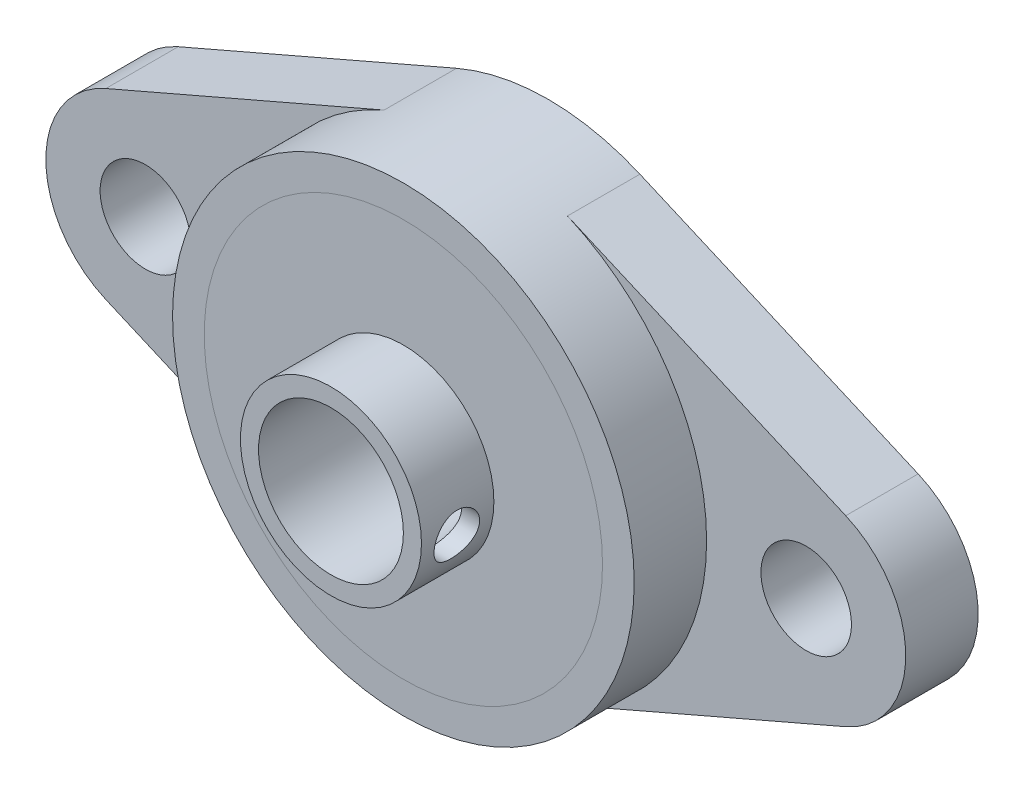
ISO-10303-21;
HEADER;
FILE_DESCRIPTION(('STEP AP214'),'2;1');
FILE_NAME('part.step','',(''),(''),'','','');
FILE_SCHEMA(('AUTOMOTIVE_DESIGN { 1 0 10303 214 1 1 1 1 }'));
ENDSEC;
DATA;
#1=APPLICATION_CONTEXT('core data for automotive mechanical design processes');
#2=APPLICATION_PROTOCOL_DEFINITION('international standard','automotive_design',2000,#1);
#3=PRODUCT_CONTEXT('',#1,'mechanical');
#4=PRODUCT('Part','Part','',(#3));
#5=PRODUCT_RELATED_PRODUCT_CATEGORY('part','',(#4));
#6=PRODUCT_DEFINITION_FORMATION('','',#4);
#7=PRODUCT_DEFINITION_CONTEXT('part definition',#1,'design');
#8=PRODUCT_DEFINITION('design','',#6,#7);
#9=PRODUCT_DEFINITION_SHAPE('','',#8);
#10=(LENGTH_UNIT() NAMED_UNIT(*) SI_UNIT(.MILLI.,.METRE.));
#11=(NAMED_UNIT(*) PLANE_ANGLE_UNIT() SI_UNIT($,.RADIAN.));
#12=(NAMED_UNIT(*) SI_UNIT($,.STERADIAN.) SOLID_ANGLE_UNIT());
#13=UNCERTAINTY_MEASURE_WITH_UNIT(LENGTH_MEASURE(1.E-05),#10,'distance_accuracy_value','');
#14=(GEOMETRIC_REPRESENTATION_CONTEXT(3) GLOBAL_UNCERTAINTY_ASSIGNED_CONTEXT((#13)) GLOBAL_UNIT_ASSIGNED_CONTEXT((#10,
#11,#12)) REPRESENTATION_CONTEXT('',''));
#15=CARTESIAN_POINT('',(0.,0.,0.));
#16=DIRECTION('',(0.,0.,1.));
#17=DIRECTION('',(1.,0.,0.));
#18=AXIS2_PLACEMENT_3D('',#15,#16,#17);
#19=CARTESIAN_POINT('',(0.,0.,8.));
#20=DIRECTION('',(0.,0.,1.));
#21=DIRECTION('',(1.,0.,0.));
#22=AXIS2_PLACEMENT_3D('',#19,#20,#21);
#23=PLANE('',#22);
#24=CARTESIAN_POINT('',(0.,0.,8.));
#25=DIRECTION('',(0.,0.,1.));
#26=DIRECTION('',(1.,0.,0.));
#27=AXIS2_PLACEMENT_3D('',#24,#25,#26);
#28=CIRCLE('',#27,11.);
#29=CARTESIAN_POINT('',(11.,0.,8.));
#30=VERTEX_POINT('',#29);
#31=EDGE_CURVE('E59',#30,#30,#28,.T.);
#32=ORIENTED_EDGE('',*,*,#31,.T.);
#33=EDGE_LOOP('',(#32));
#34=FACE_BOUND('',#33,.T.);
#35=CARTESIAN_POINT('',(0.,0.,8.));
#36=DIRECTION('',(0.,0.,1.));
#37=DIRECTION('',(1.,0.,0.));
#38=AXIS2_PLACEMENT_3D('',#35,#36,#37);
#39=CIRCLE('',#38,5.);
#40=CARTESIAN_POINT('',(5.,0.,8.));
#41=VERTEX_POINT('',#40);
#42=EDGE_CURVE('E68',#41,#41,#39,.T.);
#43=ORIENTED_EDGE('',*,*,#42,.F.);
#44=EDGE_LOOP('',(#43));
#45=FACE_BOUND('',#44,.T.);
#46=ADVANCED_FACE('F48',(#34,#45),#23,.T.);
#47=CARTESIAN_POINT('',(0.,0.,4.));
#48=DIRECTION('',(0.,0.,1.));
#49=DIRECTION('',(1.,0.,0.));
#50=AXIS2_PLACEMENT_3D('',#47,#48,#49);
#51=PLANE('',#50);
#52=CARTESIAN_POINT('',(0.,0.,4.));
#53=DIRECTION('',(0.,0.,1.));
#54=DIRECTION('',(1.,0.,0.));
#55=AXIS2_PLACEMENT_3D('',#52,#53,#54);
#56=CIRCLE('',#55,11.);
#57=CARTESIAN_POINT('',(11.,0.,4.));
#58=VERTEX_POINT('',#57);
#59=EDGE_CURVE('E63',#58,#58,#56,.T.);
#60=ORIENTED_EDGE('',*,*,#59,.F.);
#61=EDGE_LOOP('',(#60));
#62=FACE_BOUND('',#61,.T.);
#63=CARTESIAN_POINT('',(0.,0.,4.));
#64=DIRECTION('',(0.,0.,1.));
#65=DIRECTION('',(1.,0.,0.));
#66=AXIS2_PLACEMENT_3D('',#63,#64,#65);
#67=CIRCLE('',#66,5.);
#68=CARTESIAN_POINT('',(5.,0.,4.));
#69=VERTEX_POINT('',#68);
#70=EDGE_CURVE('E72',#69,#69,#67,.F.);
#71=ORIENTED_EDGE('',*,*,#70,.F.);
#72=EDGE_LOOP('',(#71));
#73=FACE_BOUND('',#72,.T.);
#74=ADVANCED_FACE('F107',(#62,#73),#51,.F.);
#75=CARTESIAN_POINT('',(0.,0.,8.));
#76=DIRECTION('',(0.,0.,-1.));
#77=DIRECTION('',(-1.,0.,0.));
#78=AXIS2_PLACEMENT_3D('',#75,#76,#77);
#79=CYLINDRICAL_SURFACE('',#78,11.);
#80=ORIENTED_EDGE('',*,*,#31,.F.);
#81=EDGE_LOOP('',(#80));
#82=FACE_BOUND('',#81,.T.);
#83=ORIENTED_EDGE('',*,*,#59,.T.);
#84=EDGE_LOOP('',(#83));
#85=FACE_BOUND('',#84,.T.);
#86=ADVANCED_FACE('F50',(#82,#85),#79,.T.);
#87=CARTESIAN_POINT('',(0.,0.,12.));
#88=DIRECTION('',(0.,0.,-1.));
#89=DIRECTION('',(-1.,0.,0.));
#90=AXIS2_PLACEMENT_3D('',#87,#88,#89);
#91=CYLINDRICAL_SURFACE('',#90,5.);
#92=CARTESIAN_POINT('',(0.,0.,0.));
#93=DIRECTION('',(0.,0.,1.));
#94=DIRECTION('',(1.,0.,0.));
#95=AXIS2_PLACEMENT_3D('',#92,#93,#94);
#96=CIRCLE('',#95,5.);
#97=CARTESIAN_POINT('',(5.,0.,0.));
#98=VERTEX_POINT('',#97);
#99=EDGE_CURVE('E76',#98,#98,#96,.T.);
#100=ORIENTED_EDGE('',*,*,#99,.T.);
#101=EDGE_LOOP('',(#100));
#102=FACE_BOUND('',#101,.T.);
#103=ORIENTED_EDGE('',*,*,#70,.T.);
#104=EDGE_LOOP('',(#103));
#105=FACE_BOUND('',#104,.T.);
#106=ADVANCED_FACE('F118',(#102,#105),#91,.T.);
#107=CARTESIAN_POINT('',(0.,0.,12.));
#108=DIRECTION('',(0.,0.,1.));
#109=DIRECTION('',(1.,0.,0.));
#110=AXIS2_PLACEMENT_3D('',#107,#108,#109);
#111=PLANE('',#110);
#112=CARTESIAN_POINT('',(0.,0.,12.));
#113=DIRECTION('',(0.,0.,1.));
#114=DIRECTION('',(1.,0.,0.));
#115=AXIS2_PLACEMENT_3D('',#112,#113,#114);
#116=CIRCLE('',#115,5.);
#117=CARTESIAN_POINT('',(5.,0.,12.));
#118=VERTEX_POINT('',#117);
#119=EDGE_CURVE('E75',#118,#118,#116,.T.);
#120=ORIENTED_EDGE('',*,*,#119,.T.);
#121=EDGE_LOOP('',(#120));
#122=FACE_BOUND('',#121,.T.);
#123=CARTESIAN_POINT('',(0.,0.,12.));
#124=DIRECTION('',(0.,0.,1.));
#125=DIRECTION('',(1.,0.,0.));
#126=AXIS2_PLACEMENT_3D('',#123,#124,#125);
#127=CIRCLE('',#126,4.);
#128=CARTESIAN_POINT('',(4.,0.,12.));
#129=VERTEX_POINT('',#128);
#130=EDGE_CURVE('E79',#129,#129,#127,.T.);
#131=ORIENTED_EDGE('',*,*,#130,.F.);
#132=EDGE_LOOP('',(#131));
#133=FACE_BOUND('',#132,.T.);
#134=ADVANCED_FACE('F120',(#122,#133),#111,.T.);
#135=CARTESIAN_POINT('',(0.,0.,0.));
#136=DIRECTION('',(0.,0.,1.));
#137=DIRECTION('',(1.,0.,0.));
#138=AXIS2_PLACEMENT_3D('',#135,#136,#137);
#139=PLANE('',#138);
#140=ORIENTED_EDGE('',*,*,#99,.F.);
#141=EDGE_LOOP('',(#140));
#142=FACE_BOUND('',#141,.T.);
#143=CARTESIAN_POINT('',(0.,0.,0.));
#144=DIRECTION('',(0.,0.,1.));
#145=DIRECTION('',(1.,0.,0.));
#146=AXIS2_PLACEMENT_3D('',#143,#144,#145);
#147=CIRCLE('',#146,4.);
#148=CARTESIAN_POINT('',(4.,0.,0.));
#149=VERTEX_POINT('',#148);
#150=EDGE_CURVE('E82',#149,#149,#147,.T.);
#151=ORIENTED_EDGE('',*,*,#150,.T.);
#152=EDGE_LOOP('',(#151));
#153=FACE_BOUND('',#152,.T.);
#154=ADVANCED_FACE('F117',(#142,#153),#139,.F.);
#155=CARTESIAN_POINT('',(4.95473362883362,-0.671278382867513,8.75000000000001));
#156=CARTESIAN_POINT('',(4.94512432398613,-0.742192184027193,8.75000258028003));
#157=CARTESIAN_POINT('',(4.93397593841791,-0.812928784277491,8.75605538247951));
#158=CARTESIAN_POINT('',(4.90905107504939,-0.951956265350667,8.77987504923985));
#159=CARTESIAN_POINT('',(4.89527214535078,-1.02024479325679,8.7976528808097));
#160=CARTESIAN_POINT('',(4.8658600629558,-1.15237989223721,8.8441725561435));
#161=CARTESIAN_POINT('',(4.85023073550853,-1.21623520865513,8.87289204431075));
#162=CARTESIAN_POINT('',(4.81803674006436,-1.3380952361234,8.94041992332771));
#163=CARTESIAN_POINT('',(4.80147205783771,-1.39609985812858,8.97922846769658));
#164=CARTESIAN_POINT('',(4.76799723314187,-1.50653007767853,9.06726800584633));
#165=CARTESIAN_POINT('',(4.75109165377322,-1.55873583929604,9.11677697856215));
#166=CARTESIAN_POINT('',(4.71873919427298,-1.65409837841083,9.2242889502439));
#167=CARTESIAN_POINT('',(4.70329244443491,-1.6972543480566,9.28229270673292));
#168=CARTESIAN_POINT('',(4.675266151163,-1.77299616881338,9.40510704021256));
#169=CARTESIAN_POINT('',(4.66267399498911,-1.80562879779027,9.46988574985182));
#170=CARTESIAN_POINT('',(4.64152109126352,-1.85933420411227,9.60467960500248));
#171=CARTESIAN_POINT('',(4.63295805750083,-1.88041353816828,9.67469175474622));
#172=CARTESIAN_POINT('',(4.62119831490188,-1.90912346666035,9.81314673869915));
#173=CARTESIAN_POINT('',(4.61769290440751,-1.91752927291539,9.88140266574818));
#174=CARTESIAN_POINT('',(4.61540944150434,-1.9230203060244,10.0184379238637));
#175=CARTESIAN_POINT('',(4.61662989764989,-1.9201091044342,10.0872170829645));
#176=CARTESIAN_POINT('',(4.62348510743728,-1.90353778121265,10.219708272131));
#177=CARTESIAN_POINT('',(4.62889568129619,-1.89042339056808,10.2835015450174));
#178=CARTESIAN_POINT('',(4.64335437913708,-1.85462384871559,10.4079024793509));
#179=CARTESIAN_POINT('',(4.6524029719482,-1.83193746395237,10.4685097290785));
#180=CARTESIAN_POINT('',(4.67365107281098,-1.77703971934372,10.5866402357642));
#181=CARTESIAN_POINT('',(4.68592761680718,-1.7445922185518,10.6440394620895));
#182=CARTESIAN_POINT('',(4.71253772867026,-1.67137750447181,10.7527277735878));
#183=CARTESIAN_POINT('',(4.72687195785737,-1.63060761466331,10.8040148846497));
#184=CARTESIAN_POINT('',(4.75761998917701,-1.53868603957769,10.9027517676194));
#185=CARTESIAN_POINT('',(4.77410903634523,-1.48701212674901,10.9496926101847));
#186=CARTESIAN_POINT('',(4.80711218902607,-1.37658697744447,11.0343512919694));
#187=CARTESIAN_POINT('',(4.82362629992038,-1.31783391239703,11.0720667405791));
#188=CARTESIAN_POINT('',(4.85618602915876,-1.19239280008988,11.1384881965996));
#189=CARTESIAN_POINT('',(4.87219278810207,-1.12549392771584,11.1668168115672));
#190=CARTESIAN_POINT('',(4.90205061482996,-0.987363356298275,11.2115517705921));
#191=CARTESIAN_POINT('',(4.91590203916821,-0.91613237662602,11.2279600882567));
#192=CARTESIAN_POINT('',(4.94037761164704,-0.773173614906652,11.2478767859426));
#193=CARTESIAN_POINT('',(4.9510726303712,-0.701500943577721,11.2516919190146));
#194=CARTESIAN_POINT('',(4.96927228161294,-0.558164420466073,11.246933506599));
#195=CARTESIAN_POINT('',(4.97677775753725,-0.486500571367544,11.2383632388082));
#196=CARTESIAN_POINT('',(4.98831152908671,-0.348366693935925,11.2095460579959));
#197=CARTESIAN_POINT('',(4.99246976396494,-0.281804183870605,11.1897922575645));
#198=CARTESIAN_POINT('',(4.99808297157258,-0.152771517038234,11.1394931234056));
#199=CARTESIAN_POINT('',(4.99953807439839,-0.090301163463396,11.1089483091124));
#200=CARTESIAN_POINT('',(5.00026866188326,0.0281283384276601,11.0382865199636));
#201=CARTESIAN_POINT('',(4.99956566033651,0.0841460166167359,10.9982676732101));
#202=CARTESIAN_POINT('',(4.99670745072671,0.188844627957427,10.9096124501691));
#203=CARTESIAN_POINT('',(4.99455211528812,0.237524917132107,10.8609753182992));
#204=CARTESIAN_POINT('',(4.98950337169292,0.326954225428666,10.7555689075752));
#205=CARTESIAN_POINT('',(4.98659873377749,0.367564273907156,10.6986822371489));
#206=CARTESIAN_POINT('',(4.98084058501877,0.438756648747818,10.5789423870591));
#207=CARTESIAN_POINT('',(4.97798707655181,0.469338510169739,10.5160889309297));
#208=CARTESIAN_POINT('',(4.97296626581298,0.519867091939617,10.3855122540718));
#209=CARTESIAN_POINT('',(4.97080585379997,0.539708295290015,10.317747880148));
#210=CARTESIAN_POINT('',(4.96768517942538,0.567719351552085,10.1798225954252));
#211=CARTESIAN_POINT('',(4.96672486397624,0.575889720737981,10.1096617907759));
#212=CARTESIAN_POINT('',(4.96621093975135,0.580305037020225,9.96933798849631));
#213=CARTESIAN_POINT('',(4.96664982202863,0.576613640728685,9.89917701646992));
#214=CARTESIAN_POINT('',(4.96882511523487,0.557554680523268,9.76048073887894));
#215=CARTESIAN_POINT('',(4.97056153830366,0.542187007365736,9.69194544853048));
#216=CARTESIAN_POINT('',(4.974955786359,0.50025491259147,9.55853385251147));
#217=CARTESIAN_POINT('',(4.97761227716077,0.473706691847854,9.49365240594934));
#218=CARTESIAN_POINT('',(4.98324973854332,0.410164288151079,9.36923744412605));
#219=CARTESIAN_POINT('',(4.98623072428223,0.373169617083942,9.30970417893189));
#220=CARTESIAN_POINT('',(4.99178947355156,0.289486355009067,9.19727134935337));
#221=CARTESIAN_POINT('',(4.99436453907587,0.242737336768629,9.14441660009683));
#222=CARTESIAN_POINT('',(4.99827050120662,0.140987762025899,9.04728283748373));
#223=CARTESIAN_POINT('',(4.99960129512639,0.0859865249228866,9.00300453215901));
#224=CARTESIAN_POINT('',(5.00024420327807,-0.030397619228588,8.92451174216448));
#225=CARTESIAN_POINT('',(4.99956624755665,-0.0917476922812463,8.89024866959376));
#226=CARTESIAN_POINT('',(4.99559768351135,-0.219215359578227,8.83251299855222));
#227=CARTESIAN_POINT('',(4.99230920124695,-0.285329034437858,8.80903164381041));
#228=CARTESIAN_POINT('',(4.98385504731463,-0.404873827838776,8.77752989309636));
#229=CARTESIAN_POINT('',(4.97928957999224,-0.457753209205068,8.76720328809396));
#230=CARTESIAN_POINT('',(4.96835242328858,-0.564214781792941,8.7534373516042));
#231=CARTESIAN_POINT('',(4.96198072501683,-0.617796976472618,8.74999805401766));
#232=CARTESIAN_POINT('',(4.95473362883362,-0.671278382867513,8.75000000000001));
#233=B_SPLINE_CURVE_WITH_KNOTS('',3,(#155,#156,#157,#158,#159,#160,#161,#162,#163,#164,#165,
#166,#167,#168,#169,#170,#171,#172,#173,#174,#175,#176,#177,#178,#179,#180,#181,#182,#183,#184,
#185,#186,#187,#188,#189,#190,#191,#192,#193,#194,#195,#196,#197,#198,#199,#200,#201,#202,#203,
#204,#205,#206,#207,#208,#209,#210,#211,#212,#213,#214,#215,#216,#217,#218,#219,#220,#221,#222,
#223,#224,#225,#226,#227,#228,#229,#230,#231,#232),.UNSPECIFIED.,.T.,.F.,(4,2,2,2,2,2,2,2,2,2,2,
2,2,2,2,2,2,2,2,2,2,2,2,2,2,2,2,2,2,2,2,2,2,2,2,2,2,2,4),(0.,0.214481445895414,
0.429163792117538,0.643409839252829,0.857659146633592,1.07834210545147,1.29904475568778,
1.51875237454171,1.73833517576273,1.94384765203175,2.1492952754971,2.34445177901437,
2.53963344028856,2.73997945733794,2.94039000843232,3.1546284286122,3.36892230649357,
3.59100695185729,3.81305481895405,4.02965234880117,4.24619256834811,4.45385527708148,
4.6615079911604,4.86709739432015,5.07270483084813,5.28159349440073,5.49049184136069,
5.70140680223967,5.91231243273757,6.12208812428009,6.33186577851548,6.54134050029492,
6.75082501147271,6.96164798451843,7.17248835473017,7.38228819902899,7.59191735366251,
7.75367307290599,7.91542958834461),.UNSPECIFIED.);
#234=CARTESIAN_POINT('',(4.95473362883362,-0.671278382867513,8.75000000000001));
#235=VERTEX_POINT('',#234);
#236=EDGE_CURVE('E11',#235,#235,#233,.T.);
#237=ORIENTED_EDGE('',*,*,#236,.T.);
#238=EDGE_LOOP('',(#237));
#239=FACE_BOUND('',#238,.T.);
#240=ORIENTED_EDGE('',*,*,#42,.T.);
#241=EDGE_LOOP('',(#240));
#242=FACE_BOUND('',#241,.T.);
#243=ORIENTED_EDGE('',*,*,#119,.F.);
#244=EDGE_LOOP('',(#243));
#245=FACE_BOUND('',#244,.T.);
#246=ADVANCED_FACE('F103',(#239,#242,#245),#91,.T.);
#247=CARTESIAN_POINT('',(0.,0.,12.));
#248=DIRECTION('',(0.,0.,-1.));
#249=DIRECTION('',(-1.,0.,0.));
#250=AXIS2_PLACEMENT_3D('',#247,#248,#249);
#251=CYLINDRICAL_SURFACE('',#250,4.);
#252=CARTESIAN_POINT('',(3.94327089263403,-0.671278382867513,8.75000000000001));
#253=CARTESIAN_POINT('',(3.93114196248786,-0.742517118784526,8.75000189235861));
#254=CARTESIAN_POINT('',(3.91706292991898,-0.813442686777589,8.75611112829209));
#255=CARTESIAN_POINT('',(3.88558193044837,-0.95255085886349,8.78000955090203));
#256=CARTESIAN_POINT('',(3.86817741743792,-1.02073131245372,8.79780771265915));
#257=CARTESIAN_POINT('',(3.83101739258076,-1.15237689983369,8.84418797642203));
#258=CARTESIAN_POINT('',(3.81126883657208,-1.215855119799,8.87273869275271));
#259=CARTESIAN_POINT('',(3.7705091916413,-1.33691630214914,8.93971005372522));
#260=CARTESIAN_POINT('',(3.74949792546057,-1.39449843376185,8.97813208658872));
#261=CARTESIAN_POINT('',(3.70648133401174,-1.50522248035507,9.0660429701896));
#262=CARTESIAN_POINT('',(3.68447772517108,-1.55800878525753,9.11598168781022));
#263=CARTESIAN_POINT('',(3.64218759691293,-1.6544630456805,9.2246757769556));
#264=CARTESIAN_POINT('',(3.62190151271173,-1.69812869413823,9.28343337276483));
#265=CARTESIAN_POINT('',(3.58494062374308,-1.77482774164582,9.40836278351827));
#266=CARTESIAN_POINT('',(3.56825654479299,-1.80788855463148,9.47451487586516));
#267=CARTESIAN_POINT('',(3.5403052226424,-1.86203645796701,9.61260119050216));
#268=CARTESIAN_POINT('',(3.52903185890208,-1.88313708246196,9.68452877155682));
#269=CARTESIAN_POINT('',(3.51419551228336,-1.91066720180612,9.82410048576407));
#270=CARTESIAN_POINT('',(3.50995543820638,-1.91838879739744,9.89141778502608));
#271=CARTESIAN_POINT('',(3.50753067864982,-1.92282046484765,10.0265108603823));
#272=CARTESIAN_POINT('',(3.50934317692844,-1.91953565794662,10.0942864086083));
#273=CARTESIAN_POINT('',(3.51839857546887,-1.90287823806946,10.222475555077));
#274=CARTESIAN_POINT('',(3.52518258136448,-1.8903575359295,10.2830361796933));
#275=CARTESIAN_POINT('',(3.54298490611242,-1.85677581805526,10.4010774306992));
#276=CARTESIAN_POINT('',(3.55400408618153,-1.83571306525875,10.458557427937));
#277=CARTESIAN_POINT('',(3.57991467553788,-1.78467425091387,10.5717316965974));
#278=CARTESIAN_POINT('',(3.59495867766409,-1.75433814317093,10.6272276232991));
#279=CARTESIAN_POINT('',(3.62747411357035,-1.68607819426941,10.732546336218));
#280=CARTESIAN_POINT('',(3.64494661333234,-1.64815101779884,10.7823666135551));
#281=CARTESIAN_POINT('',(3.68320267632826,-1.56093803224926,10.8807947591354));
#282=CARTESIAN_POINT('',(3.70413776246198,-1.51085515085325,10.9286390111189));
#283=CARTESIAN_POINT('',(3.74612671890757,-1.40351599209565,11.0154287773813));
#284=CARTESIAN_POINT('',(3.76718063783222,-1.3462565396419,11.0543703312171));
#285=CARTESIAN_POINT('',(3.80934451784821,-1.22206601814079,11.1245091172014));
#286=CARTESIAN_POINT('',(3.83037937946737,-1.15475785470774,11.1550881672074));
#287=CARTESIAN_POINT('',(3.86973399275118,-1.01509330587347,11.2040608291551));
#288=CARTESIAN_POINT('',(3.88805445060211,-0.942738240717363,11.2224576148024));
#289=CARTESIAN_POINT('',(3.92031851273057,-0.797755750773608,11.2456699138986));
#290=CARTESIAN_POINT('',(3.93439735237753,-0.725234456974304,11.2509561823421));
#291=CARTESIAN_POINT('',(3.95845494922682,-0.579710963976722,11.248760880202));
#292=CARTESIAN_POINT('',(3.96843554001067,-0.506708994721986,11.2412850272075));
#293=CARTESIAN_POINT('',(3.98366738622146,-0.36740765499213,11.2144401437408));
#294=CARTESIAN_POINT('',(3.98918388640216,-0.300981053751118,11.1958757775946));
#295=CARTESIAN_POINT('',(3.99682648538346,-0.171923105052158,11.1479894795265));
#296=CARTESIAN_POINT('',(3.99895287432757,-0.109291433245655,11.1186684684789));
#297=CARTESIAN_POINT('',(4.00042118486959,0.00921359014119998,11.0507202939798));
#298=CARTESIAN_POINT('',(3.99981282505052,0.065188775674636,11.0122712403536));
#299=CARTESIAN_POINT('',(3.99672474133152,0.170155551372265,10.926859529259));
#300=CARTESIAN_POINT('',(3.99424479169194,0.219146298268953,10.8798958453275));
#301=CARTESIAN_POINT('',(3.98824120759921,0.309927062284755,10.7775127324718));
#302=CARTESIAN_POINT('',(3.98469438097803,0.351520446945472,10.7219202925361));
#303=CARTESIAN_POINT('',(3.97753490235486,0.424949026439982,10.6046270296734));
#304=CARTESIAN_POINT('',(3.97392224462759,0.456783368204862,10.5429256733699));
#305=CARTESIAN_POINT('',(3.96741348201169,0.510267422771577,10.4140039045436));
#306=CARTESIAN_POINT('',(3.96453028879444,0.531739011010742,10.346708789416));
#307=CARTESIAN_POINT('',(3.96020371075766,0.563062819402668,10.2094234555288));
#308=CARTESIAN_POINT('',(3.95876022452089,0.572915858009475,10.1394334269677));
#309=CARTESIAN_POINT('',(3.95762967352997,0.580674613977201,9.99930822932565));
#310=CARTESIAN_POINT('',(3.9579294956811,0.578669525733758,9.92917810030345));
#311=CARTESIAN_POINT('',(3.96019105938593,0.562981422839712,9.79026525269803));
#312=CARTESIAN_POINT('',(3.96215280966564,0.549298346873441,9.72148254119141));
#313=CARTESIAN_POINT('',(3.9673071170453,0.510732455511152,9.5874508673718));
#314=CARTESIAN_POINT('',(3.97049528388256,0.485889536921058,9.52219023644103));
#315=CARTESIAN_POINT('',(3.97739585129282,0.425717015892196,9.39672339631489));
#316=CARTESIAN_POINT('',(3.98110829980257,0.390386454208743,9.33651765010736));
#317=CARTESIAN_POINT('',(3.98819210826899,0.309792860159651,9.22222255621485));
#318=CARTESIAN_POINT('',(3.99155965202438,0.264433280120915,9.16820099356957));
#319=CARTESIAN_POINT('',(3.99689347738651,0.165237058599386,9.06850348661821));
#320=CARTESIAN_POINT('',(3.99885973047979,0.111400244649073,9.02282771214627));
#321=CARTESIAN_POINT('',(4.00040423137438,-0.00288190270296989,8.94139695684292));
#322=CARTESIAN_POINT('',(3.99999626362391,-0.0632870951251969,8.90558597129714));
#323=CARTESIAN_POINT('',(3.99602054623327,-0.189131600218819,8.84461426113502));
#324=CARTESIAN_POINT('',(3.99245475853429,-0.254567764119292,8.81944693799581));
#325=CARTESIAN_POINT('',(3.98246346100204,-0.378500883825389,8.7833189375766));
#326=CARTESIAN_POINT('',(3.9765391335161,-0.436592041464689,8.77080722060984));
#327=CARTESIAN_POINT('',(3.96194194024203,-0.553619169168558,8.75414679802883));
#328=CARTESIAN_POINT('',(3.95326896020328,-0.612555174252853,8.7499984400991));
#329=CARTESIAN_POINT('',(3.94327089263403,-0.671278382867513,8.75000000000001));
#330=B_SPLINE_CURVE_WITH_KNOTS('',3,(#252,#253,#254,#255,#256,#257,#258,#259,#260,#261,#262,
#263,#264,#265,#266,#267,#268,#269,#270,#271,#272,#273,#274,#275,#276,#277,#278,#279,#280,#281,
#282,#283,#284,#285,#286,#287,#288,#289,#290,#291,#292,#293,#294,#295,#296,#297,#298,#299,#300,
#301,#302,#303,#304,#305,#306,#307,#308,#309,#310,#311,#312,#313,#314,#315,#316,#317,#318,#319,
#320,#321,#322,#323,#324,#325,#326,#327,#328,#329),.UNSPECIFIED.,.T.,.F.,(4,2,2,2,2,2,2,2,2,2,2,
2,2,2,2,2,2,2,2,2,2,2,2,2,2,2,2,2,2,2,2,2,2,2,2,2,2,2,4),(0.,0.21656070219716,0.433287880404443,
0.64938729498855,0.865517116687611,1.09223268563284,1.31900553283726,1.54518734815601,
1.77111270260099,1.97366193100594,2.17611692706243,2.3619206309276,2.54776213772505,
2.74200889594918,2.93634118908869,3.15248390740611,3.36872259240844,3.59816701098355,
3.8275516314947,4.04857219085197,4.26949375623531,4.47605503673809,4.68259863769351,
4.88540255216391,5.08823093150428,5.29583346332057,5.50345413716186,5.71452662275323,
5.92558423872168,6.13505635183576,6.344529564797,6.5532597914671,6.76200911538188,
6.97286304408317,7.18372126311718,7.39335649001363,7.60286156266795,7.78136852914644,
7.95988291642691),.UNSPECIFIED.);
#331=CARTESIAN_POINT('',(3.94327089263403,-0.671278382867513,8.75000000000001));
#332=VERTEX_POINT('',#331);
#333=EDGE_CURVE('E85',#332,#332,#330,.T.);
#334=ORIENTED_EDGE('',*,*,#333,.F.);
#335=EDGE_LOOP('',(#334));
#336=FACE_BOUND('',#335,.T.);
#337=ORIENTED_EDGE('',*,*,#130,.T.);
#338=EDGE_LOOP('',(#337));
#339=FACE_BOUND('',#338,.T.);
#340=ORIENTED_EDGE('',*,*,#150,.F.);
#341=EDGE_LOOP('',(#340));
#342=FACE_BOUND('',#341,.T.);
#343=ADVANCED_FACE('F92',(#336,#339,#342),#251,.F.);
#344=CARTESIAN_POINT('',(5.,-0.671278382867513,10.));
#345=DIRECTION('',(1.,0.,0.));
#346=DIRECTION('',(0.,0.,-1.));
#347=AXIS2_PLACEMENT_3D('',#344,#345,#346);
#348=CYLINDRICAL_SURFACE('',#347,1.24999999999999);
#349=ORIENTED_EDGE('',*,*,#333,.T.);
#350=EDGE_LOOP('',(#349));
#351=FACE_BOUND('',#350,.T.);
#352=ORIENTED_EDGE('',*,*,#236,.F.);
#353=EDGE_LOOP('',(#352));
#354=FACE_BOUND('',#353,.T.);
#355=ADVANCED_FACE('F95',(#351,#354),#348,.F.);
#356=CLOSED_SHELL('',(#46,#74,#86,#106,#134,#154,#246,#343,#355));
#357=MANIFOLD_SOLID_BREP('B2',#356);
#358=CARTESIAN_POINT('',(0.,0.,4.));
#359=DIRECTION('',(0.,0.,1.));
#360=DIRECTION('',(1.,0.,0.));
#361=AXIS2_PLACEMENT_3D('',#358,#359,#360);
#362=PLANE('',#361);
#363=CARTESIAN_POINT('',(0.,0.,4.));
#364=DIRECTION('',(0.,0.,1.));
#365=DIRECTION('',(1.,0.,0.));
#366=AXIS2_PLACEMENT_3D('',#363,#364,#365);
#367=CIRCLE('',#366,12.75);
#368=CARTESIAN_POINT('',(-5.06506849315069,11.7007513074884,4.));
#369=VERTEX_POINT('',#368);
#370=CARTESIAN_POINT('',(-5.06506849315068,-11.7007513074884,4.));
#371=VERTEX_POINT('',#370);
#372=EDGE_CURVE('E46',#369,#371,#367,.T.);
#373=ORIENTED_EDGE('',*,*,#372,.F.);
#374=DIRECTION('',(-0.917705984901053,-0.397260273972603,0.));
#375=VECTOR('',#374,1.);
#376=CARTESIAN_POINT('',(-20.4349315068493,5.04738291695579,4.));
#377=LINE('',#376,#375);
#378=CARTESIAN_POINT('',(-20.4349315068493,5.04738291695579,4.));
#379=VERTEX_POINT('',#378);
#380=EDGE_CURVE('E280',#369,#379,#377,.T.);
#381=ORIENTED_EDGE('',*,*,#380,.T.);
#382=CARTESIAN_POINT('',(-18.25,0.,4.));
#383=DIRECTION('',(0.,0.,1.));
#384=DIRECTION('',(1.,0.,0.));
#385=AXIS2_PLACEMENT_3D('',#382,#383,#384);
#386=CIRCLE('',#385,5.5);
#387=CARTESIAN_POINT('',(-20.4349315068493,-5.04738291695579,4.));
#388=VERTEX_POINT('',#387);
#389=EDGE_CURVE('E284',#379,#388,#386,.T.);
#390=ORIENTED_EDGE('',*,*,#389,.T.);
#391=DIRECTION('',(0.917705984901053,-0.397260273972603,0.));
#392=VECTOR('',#391,1.);
#393=CARTESIAN_POINT('',(-20.4349315068493,-5.04738291695579,4.));
#394=LINE('',#393,#392);
#395=EDGE_CURVE('E225',#388,#371,#394,.T.);
#396=ORIENTED_EDGE('',*,*,#395,.T.);
#397=EDGE_LOOP('',(#373,#381,#390,#396));
#398=FACE_BOUND('',#397,.T.);
#399=CARTESIAN_POINT('',(-18.25,0.,4.));
#400=DIRECTION('',(0.,0.,1.));
#401=DIRECTION('',(1.,0.,0.));
#402=AXIS2_PLACEMENT_3D('',#399,#400,#401);
#403=CIRCLE('',#402,2.5);
#404=CARTESIAN_POINT('',(-15.75,0.,4.));
#405=VERTEX_POINT('',#404);
#406=EDGE_CURVE('E380',#405,#405,#403,.T.);
#407=ORIENTED_EDGE('',*,*,#406,.F.);
#408=EDGE_LOOP('',(#407));
#409=FACE_BOUND('',#408,.T.);
#410=ADVANCED_FACE('F206',(#398,#409),#362,.T.);
#411=CARTESIAN_POINT('',(0.,0.,4.));
#412=DIRECTION('',(0.,0.,1.));
#413=DIRECTION('',(1.,0.,0.));
#414=AXIS2_PLACEMENT_3D('',#411,#412,#413);
#415=CIRCLE('',#414,5.);
#416=CARTESIAN_POINT('',(5.,0.,4.));
#417=VERTEX_POINT('',#416);
#418=EDGE_CURVE('E308',#417,#417,#415,.T.);
#419=ORIENTED_EDGE('',*,*,#418,.F.);
#420=EDGE_LOOP('',(#419));
#421=FACE_BOUND('',#420,.T.);
#422=CARTESIAN_POINT('',(0.,0.,4.));
#423=DIRECTION('',(0.,0.,1.));
#424=DIRECTION('',(1.,0.,0.));
#425=AXIS2_PLACEMENT_3D('',#422,#423,#424);
#426=CIRCLE('',#425,11.);
#427=CARTESIAN_POINT('',(11.,0.,4.));
#428=VERTEX_POINT('',#427);
#429=EDGE_CURVE('E534',#428,#428,#426,.T.);
#430=ORIENTED_EDGE('',*,*,#429,.T.);
#431=EDGE_LOOP('',(#430));
#432=FACE_BOUND('',#431,.T.);
#433=ADVANCED_FACE('F370',(#421,#432),#362,.T.);
#434=CARTESIAN_POINT('',(5.06506849315068,-11.7007513074884,4.));
#435=VERTEX_POINT('',#434);
#436=CARTESIAN_POINT('',(5.06506849315068,11.7007513074884,4.));
#437=VERTEX_POINT('',#436);
#438=EDGE_CURVE('E216',#435,#437,#367,.T.);
#439=ORIENTED_EDGE('',*,*,#438,.F.);
#440=DIRECTION('',(0.917705984901053,0.397260273972603,0.));
#441=VECTOR('',#440,1.);
#442=CARTESIAN_POINT('',(5.06506849315068,-11.7007513074884,4.));
#443=LINE('',#442,#441);
#444=CARTESIAN_POINT('',(20.4349315068493,-5.04738291695579,4.));
#445=VERTEX_POINT('',#444);
#446=EDGE_CURVE('E319',#435,#445,#443,.T.);
#447=ORIENTED_EDGE('',*,*,#446,.T.);
#448=CARTESIAN_POINT('',(18.25,0.,4.));
#449=DIRECTION('',(0.,0.,1.));
#450=DIRECTION('',(1.,0.,0.));
#451=AXIS2_PLACEMENT_3D('',#448,#449,#450);
#452=CIRCLE('',#451,5.5);
#453=CARTESIAN_POINT('',(20.4349315068493,5.04738291695579,4.));
#454=VERTEX_POINT('',#453);
#455=EDGE_CURVE('E302',#445,#454,#452,.T.);
#456=ORIENTED_EDGE('',*,*,#455,.T.);
#457=DIRECTION('',(-0.917705984901053,0.397260273972603,0.));
#458=VECTOR('',#457,1.);
#459=CARTESIAN_POINT('',(5.06506849315069,11.7007513074884,4.));
#460=LINE('',#459,#458);
#461=EDGE_CURVE('E288',#454,#437,#460,.T.);
#462=ORIENTED_EDGE('',*,*,#461,.T.);
#463=EDGE_LOOP('',(#439,#447,#456,#462));
#464=FACE_BOUND('',#463,.T.);
#465=CARTESIAN_POINT('',(18.25,0.,4.));
#466=DIRECTION('',(0.,0.,1.));
#467=DIRECTION('',(1.,0.,0.));
#468=AXIS2_PLACEMENT_3D('',#465,#466,#467);
#469=CIRCLE('',#468,2.5);
#470=CARTESIAN_POINT('',(20.75,0.,4.));
#471=VERTEX_POINT('',#470);
#472=EDGE_CURVE('E374',#471,#471,#469,.T.);
#473=ORIENTED_EDGE('',*,*,#472,.F.);
#474=EDGE_LOOP('',(#473));
#475=FACE_BOUND('',#474,.T.);
#476=ADVANCED_FACE('F367',(#464,#475),#362,.T.);
#477=CARTESIAN_POINT('',(0.,0.,0.));
#478=DIRECTION('',(0.,0.,1.));
#479=DIRECTION('',(1.,0.,0.));
#480=AXIS2_PLACEMENT_3D('',#477,#478,#479);
#481=PLANE('',#480);
#482=CARTESIAN_POINT('',(-18.25,0.,0.));
#483=DIRECTION('',(0.,0.,1.));
#484=DIRECTION('',(1.,0.,0.));
#485=AXIS2_PLACEMENT_3D('',#482,#483,#484);
#486=CIRCLE('',#485,2.5);
#487=CARTESIAN_POINT('',(-15.75,0.,0.));
#488=VERTEX_POINT('',#487);
#489=EDGE_CURVE('E376',#488,#488,#486,.T.);
#490=ORIENTED_EDGE('',*,*,#489,.T.);
#491=EDGE_LOOP('',(#490));
#492=FACE_BOUND('',#491,.T.);
#493=CARTESIAN_POINT('',(0.,0.,0.));
#494=DIRECTION('',(0.,0.,1.));
#495=DIRECTION('',(1.,0.,0.));
#496=AXIS2_PLACEMENT_3D('',#493,#494,#495);
#497=CIRCLE('',#496,12.75);
#498=CARTESIAN_POINT('',(-5.06506849315068,-11.7007513074884,0.));
#499=VERTEX_POINT('',#498);
#500=CARTESIAN_POINT('',(5.06506849315068,-11.7007513074884,0.));
#501=VERTEX_POINT('',#500);
#502=EDGE_CURVE('E304',#499,#501,#497,.T.);
#503=ORIENTED_EDGE('',*,*,#502,.F.);
#504=DIRECTION('',(0.917705984901053,-0.397260273972603,0.));
#505=VECTOR('',#504,1.);
#506=CARTESIAN_POINT('',(-20.4349315068493,-5.04738291695579,0.));
#507=LINE('',#506,#505);
#508=CARTESIAN_POINT('',(-20.4349315068493,-5.04738291695579,0.));
#509=VERTEX_POINT('',#508);
#510=EDGE_CURVE('E261',#509,#499,#507,.T.);
#511=ORIENTED_EDGE('',*,*,#510,.F.);
#512=CARTESIAN_POINT('',(-18.25,0.,0.));
#513=DIRECTION('',(0.,0.,1.));
#514=DIRECTION('',(1.,0.,0.));
#515=AXIS2_PLACEMENT_3D('',#512,#513,#514);
#516=CIRCLE('',#515,5.5);
#517=CARTESIAN_POINT('',(-20.4349315068493,5.04738291695579,0.));
#518=VERTEX_POINT('',#517);
#519=EDGE_CURVE('E255',#518,#509,#516,.T.);
#520=ORIENTED_EDGE('',*,*,#519,.F.);
#521=DIRECTION('',(-0.917705984901053,-0.397260273972603,0.));
#522=VECTOR('',#521,1.);
#523=CARTESIAN_POINT('',(-20.4349315068493,5.04738291695579,0.));
#524=LINE('',#523,#522);
#525=CARTESIAN_POINT('',(-5.06506849315069,11.7007513074884,0.));
#526=VERTEX_POINT('',#525);
#527=EDGE_CURVE('E292',#526,#518,#524,.T.);
#528=ORIENTED_EDGE('',*,*,#527,.F.);
#529=CARTESIAN_POINT('',(0.,0.,0.));
#530=DIRECTION('',(0.,0.,1.));
#531=DIRECTION('',(1.,0.,0.));
#532=AXIS2_PLACEMENT_3D('',#529,#530,#531);
#533=CIRCLE('',#532,12.75);
#534=CARTESIAN_POINT('',(5.06506849315069,11.7007513074884,0.));
#535=VERTEX_POINT('',#534);
#536=EDGE_CURVE('E314',#535,#526,#533,.T.);
#537=ORIENTED_EDGE('',*,*,#536,.F.);
#538=DIRECTION('',(-0.917705984901053,0.397260273972603,0.));
#539=VECTOR('',#538,1.);
#540=CARTESIAN_POINT('',(5.06506849315069,11.7007513074884,0.));
#541=LINE('',#540,#539);
#542=CARTESIAN_POINT('',(20.4349315068493,5.04738291695579,0.));
#543=VERTEX_POINT('',#542);
#544=EDGE_CURVE('E312',#543,#535,#541,.T.);
#545=ORIENTED_EDGE('',*,*,#544,.F.);
#546=CARTESIAN_POINT('',(18.25,0.,0.));
#547=DIRECTION('',(0.,0.,1.));
#548=DIRECTION('',(1.,0.,0.));
#549=AXIS2_PLACEMENT_3D('',#546,#547,#548);
#550=CIRCLE('',#549,5.5);
#551=CARTESIAN_POINT('',(20.4349315068493,-5.04738291695579,0.));
#552=VERTEX_POINT('',#551);
#553=EDGE_CURVE('E310',#552,#543,#550,.T.);
#554=ORIENTED_EDGE('',*,*,#553,.F.);
#555=DIRECTION('',(0.917705984901053,0.397260273972603,0.));
#556=VECTOR('',#555,1.);
#557=CARTESIAN_POINT('',(5.06506849315068,-11.7007513074884,0.));
#558=LINE('',#557,#556);
#559=EDGE_CURVE('E307',#501,#552,#558,.T.);
#560=ORIENTED_EDGE('',*,*,#559,.F.);
#561=EDGE_LOOP('',(#503,#511,#520,#528,#537,#545,#554,#560));
#562=FACE_BOUND('',#561,.T.);
#563=CARTESIAN_POINT('',(0.,0.,0.));
#564=DIRECTION('',(0.,0.,1.));
#565=DIRECTION('',(1.,0.,0.));
#566=AXIS2_PLACEMENT_3D('',#563,#564,#565);
#567=CIRCLE('',#566,5.);
#568=CARTESIAN_POINT('',(5.,0.,0.));
#569=VERTEX_POINT('',#568);
#570=EDGE_CURVE('E389',#569,#569,#567,.T.);
#571=ORIENTED_EDGE('',*,*,#570,.T.);
#572=EDGE_LOOP('',(#571));
#573=FACE_BOUND('',#572,.T.);
#574=CARTESIAN_POINT('',(18.25,0.,0.));
#575=DIRECTION('',(0.,0.,1.));
#576=DIRECTION('',(1.,0.,0.));
#577=AXIS2_PLACEMENT_3D('',#574,#575,#576);
#578=CIRCLE('',#577,2.5);
#579=CARTESIAN_POINT('',(20.75,0.,0.));
#580=VERTEX_POINT('',#579);
#581=EDGE_CURVE('E377',#580,#580,#578,.T.);
#582=ORIENTED_EDGE('',*,*,#581,.T.);
#583=EDGE_LOOP('',(#582));
#584=FACE_BOUND('',#583,.T.);
#585=ADVANCED_FACE('F352',(#492,#562,#573,#584),#481,.F.);
#586=CARTESIAN_POINT('',(5.06506849315068,-11.7007513074884,4.));
#587=DIRECTION('',(-0.397260273972603,0.917705984901053,0.));
#588=DIRECTION('',(-0.917705984901054,-0.397260273972603,0.));
#589=AXIS2_PLACEMENT_3D('',#586,#587,#588);
#590=PLANE('',#589);
#591=ORIENTED_EDGE('',*,*,#559,.T.);
#592=DIRECTION('',(0.,0.,-1.));
#593=VECTOR('',#592,1.);
#594=CARTESIAN_POINT('',(20.4349315068493,-5.04738291695579,4.));
#595=LINE('',#594,#593);
#596=EDGE_CURVE('E324',#445,#552,#595,.T.);
#597=ORIENTED_EDGE('',*,*,#596,.F.);
#598=ORIENTED_EDGE('',*,*,#446,.F.);
#599=DIRECTION('',(0.,0.,-1.));
#600=VECTOR('',#599,1.);
#601=CARTESIAN_POINT('',(5.06506849315068,-11.7007513074884,4.));
#602=LINE('',#601,#600);
#603=EDGE_CURVE('E328',#435,#501,#602,.T.);
#604=ORIENTED_EDGE('',*,*,#603,.T.);
#605=EDGE_LOOP('',(#591,#597,#598,#604));
#606=FACE_BOUND('',#605,.T.);
#607=ADVANCED_FACE('F208',(#606),#590,.F.);
#608=CARTESIAN_POINT('',(18.25,0.,4.));
#609=DIRECTION('',(0.,0.,-1.));
#610=DIRECTION('',(-1.,0.,0.));
#611=AXIS2_PLACEMENT_3D('',#608,#609,#610);
#612=CYLINDRICAL_SURFACE('',#611,5.5);
#613=ORIENTED_EDGE('',*,*,#553,.T.);
#614=DIRECTION('',(0.,0.,-1.));
#615=VECTOR('',#614,1.);
#616=CARTESIAN_POINT('',(20.4349315068493,5.04738291695579,4.));
#617=LINE('',#616,#615);
#618=EDGE_CURVE('E321',#454,#543,#617,.T.);
#619=ORIENTED_EDGE('',*,*,#618,.F.);
#620=ORIENTED_EDGE('',*,*,#455,.F.);
#621=ORIENTED_EDGE('',*,*,#596,.T.);
#622=EDGE_LOOP('',(#613,#619,#620,#621));
#623=FACE_BOUND('',#622,.T.);
#624=ADVANCED_FACE('F359',(#623),#612,.T.);
#625=CARTESIAN_POINT('',(5.06506849315069,11.7007513074884,4.));
#626=DIRECTION('',(-0.397260273972603,-0.917705984901053,0.));
#627=DIRECTION('',(0.917705984901053,-0.397260273972603,0.));
#628=AXIS2_PLACEMENT_3D('',#625,#626,#627);
#629=PLANE('',#628);
#630=ORIENTED_EDGE('',*,*,#544,.T.);
#631=DIRECTION('',(0.,0.,-1.));
#632=VECTOR('',#631,1.);
#633=CARTESIAN_POINT('',(5.06506849315069,11.7007513074884,4.));
#634=LINE('',#633,#632);
#635=EDGE_CURVE('E325',#437,#535,#634,.T.);
#636=ORIENTED_EDGE('',*,*,#635,.F.);
#637=ORIENTED_EDGE('',*,*,#461,.F.);
#638=ORIENTED_EDGE('',*,*,#618,.T.);
#639=EDGE_LOOP('',(#630,#636,#637,#638));
#640=FACE_BOUND('',#639,.T.);
#641=ADVANCED_FACE('F363',(#640),#629,.F.);
#642=CARTESIAN_POINT('',(0.,0.,4.));
#643=DIRECTION('',(0.,0.,-1.));
#644=DIRECTION('',(-1.,0.,0.));
#645=AXIS2_PLACEMENT_3D('',#642,#643,#644);
#646=CYLINDRICAL_SURFACE('',#645,12.75);
#647=ORIENTED_EDGE('',*,*,#536,.T.);
#648=DIRECTION('',(0.,0.,-1.));
#649=VECTOR('',#648,1.);
#650=CARTESIAN_POINT('',(-5.06506849315069,11.7007513074884,4.));
#651=LINE('',#650,#649);
#652=EDGE_CURVE('E293',#369,#526,#651,.T.);
#653=ORIENTED_EDGE('',*,*,#652,.F.);
#654=ORIENTED_EDGE('',*,*,#372,.T.);
#655=DIRECTION('',(0.,0.,-1.));
#656=VECTOR('',#655,1.);
#657=CARTESIAN_POINT('',(-5.06506849315068,-11.7007513074884,4.));
#658=LINE('',#657,#656);
#659=EDGE_CURVE('E298',#371,#499,#658,.T.);
#660=ORIENTED_EDGE('',*,*,#659,.T.);
#661=ORIENTED_EDGE('',*,*,#502,.T.);
#662=ORIENTED_EDGE('',*,*,#603,.F.);
#663=ORIENTED_EDGE('',*,*,#438,.T.);
#664=ORIENTED_EDGE('',*,*,#635,.T.);
#665=EDGE_LOOP('',(#647,#653,#654,#660,#661,#662,#663,#664));
#666=FACE_BOUND('',#665,.T.);
#667=CARTESIAN_POINT('',(0.,0.,8.));
#668=DIRECTION('',(0.,0.,1.));
#669=DIRECTION('',(1.,0.,0.));
#670=AXIS2_PLACEMENT_3D('',#667,#668,#669);
#671=CIRCLE('',#670,12.75);
#672=CARTESIAN_POINT('',(12.75,0.,8.));
#673=VERTEX_POINT('',#672);
#674=EDGE_CURVE('E383',#673,#673,#671,.T.);
#675=ORIENTED_EDGE('',*,*,#674,.F.);
#676=EDGE_LOOP('',(#675));
#677=FACE_BOUND('',#676,.T.);
#678=ADVANCED_FACE('F349',(#666,#677),#646,.T.);
#679=CARTESIAN_POINT('',(-20.4349315068493,5.04738291695579,4.));
#680=DIRECTION('',(0.397260273972603,-0.917705984901053,0.));
#681=DIRECTION('',(0.917705984901054,0.397260273972603,0.));
#682=AXIS2_PLACEMENT_3D('',#679,#680,#681);
#683=PLANE('',#682);
#684=ORIENTED_EDGE('',*,*,#527,.T.);
#685=DIRECTION('',(0.,0.,-1.));
#686=VECTOR('',#685,1.);
#687=CARTESIAN_POINT('',(-20.4349315068493,5.04738291695579,4.));
#688=LINE('',#687,#686);
#689=EDGE_CURVE('E289',#379,#518,#688,.T.);
#690=ORIENTED_EDGE('',*,*,#689,.F.);
#691=ORIENTED_EDGE('',*,*,#380,.F.);
#692=ORIENTED_EDGE('',*,*,#652,.T.);
#693=EDGE_LOOP('',(#684,#690,#691,#692));
#694=FACE_BOUND('',#693,.T.);
#695=ADVANCED_FACE('F290',(#694),#683,.F.);
#696=CARTESIAN_POINT('',(-18.25,0.,4.));
#697=DIRECTION('',(0.,0.,-1.));
#698=DIRECTION('',(-1.,0.,0.));
#699=AXIS2_PLACEMENT_3D('',#696,#697,#698);
#700=CYLINDRICAL_SURFACE('',#699,5.5);
#701=ORIENTED_EDGE('',*,*,#519,.T.);
#702=DIRECTION('',(0.,0.,-1.));
#703=VECTOR('',#702,1.);
#704=CARTESIAN_POINT('',(-20.4349315068493,-5.04738291695579,4.));
#705=LINE('',#704,#703);
#706=EDGE_CURVE('E294',#388,#509,#705,.T.);
#707=ORIENTED_EDGE('',*,*,#706,.F.);
#708=ORIENTED_EDGE('',*,*,#389,.F.);
#709=ORIENTED_EDGE('',*,*,#689,.T.);
#710=EDGE_LOOP('',(#701,#707,#708,#709));
#711=FACE_BOUND('',#710,.T.);
#712=ADVANCED_FACE('F296',(#711),#700,.T.);
#713=CARTESIAN_POINT('',(-20.4349315068493,-5.04738291695579,4.));
#714=DIRECTION('',(0.397260273972603,0.917705984901053,0.));
#715=DIRECTION('',(-0.917705984901054,0.397260273972603,0.));
#716=AXIS2_PLACEMENT_3D('',#713,#714,#715);
#717=PLANE('',#716);
#718=ORIENTED_EDGE('',*,*,#510,.T.);
#719=ORIENTED_EDGE('',*,*,#659,.F.);
#720=ORIENTED_EDGE('',*,*,#395,.F.);
#721=ORIENTED_EDGE('',*,*,#706,.T.);
#722=EDGE_LOOP('',(#718,#719,#720,#721));
#723=FACE_BOUND('',#722,.T.);
#724=ADVANCED_FACE('F399',(#723),#717,.F.);
#725=CARTESIAN_POINT('',(0.,0.,4.));
#726=DIRECTION('',(0.,0.,-1.));
#727=DIRECTION('',(-1.,0.,0.));
#728=AXIS2_PLACEMENT_3D('',#725,#726,#727);
#729=CYLINDRICAL_SURFACE('',#728,5.);
#730=ORIENTED_EDGE('',*,*,#418,.T.);
#731=EDGE_LOOP('',(#730));
#732=FACE_BOUND('',#731,.T.);
#733=ORIENTED_EDGE('',*,*,#570,.F.);
#734=EDGE_LOOP('',(#733));
#735=FACE_BOUND('',#734,.T.);
#736=ADVANCED_FACE('F396',(#732,#735),#729,.F.);
#737=CARTESIAN_POINT('',(-18.25,0.,4.));
#738=DIRECTION('',(0.,0.,-1.));
#739=DIRECTION('',(-1.,0.,0.));
#740=AXIS2_PLACEMENT_3D('',#737,#738,#739);
#741=CYLINDRICAL_SURFACE('',#740,2.5);
#742=ORIENTED_EDGE('',*,*,#406,.T.);
#743=EDGE_LOOP('',(#742));
#744=FACE_BOUND('',#743,.T.);
#745=ORIENTED_EDGE('',*,*,#489,.F.);
#746=EDGE_LOOP('',(#745));
#747=FACE_BOUND('',#746,.T.);
#748=ADVANCED_FACE('F398',(#744,#747),#741,.F.);
#749=CARTESIAN_POINT('',(18.25,0.,4.));
#750=DIRECTION('',(0.,0.,-1.));
#751=DIRECTION('',(-1.,0.,0.));
#752=AXIS2_PLACEMENT_3D('',#749,#750,#751);
#753=CYLINDRICAL_SURFACE('',#752,2.5);
#754=ORIENTED_EDGE('',*,*,#472,.T.);
#755=EDGE_LOOP('',(#754));
#756=FACE_BOUND('',#755,.T.);
#757=ORIENTED_EDGE('',*,*,#581,.F.);
#758=EDGE_LOOP('',(#757));
#759=FACE_BOUND('',#758,.T.);
#760=ADVANCED_FACE('F406',(#756,#759),#753,.F.);
#761=CARTESIAN_POINT('',(0.,0.,8.));
#762=DIRECTION('',(0.,0.,1.));
#763=DIRECTION('',(1.,0.,0.));
#764=AXIS2_PLACEMENT_3D('',#761,#762,#763);
#765=PLANE('',#764);
#766=ORIENTED_EDGE('',*,*,#674,.T.);
#767=EDGE_LOOP('',(#766));
#768=FACE_BOUND('',#767,.T.);
#769=CARTESIAN_POINT('',(0.,0.,8.));
#770=DIRECTION('',(0.,0.,1.));
#771=DIRECTION('',(1.,0.,0.));
#772=AXIS2_PLACEMENT_3D('',#769,#770,#771);
#773=CIRCLE('',#772,11.);
#774=CARTESIAN_POINT('',(11.,0.,8.));
#775=VERTEX_POINT('',#774);
#776=EDGE_CURVE('E531',#775,#775,#773,.T.);
#777=ORIENTED_EDGE('',*,*,#776,.F.);
#778=EDGE_LOOP('',(#777));
#779=FACE_BOUND('',#778,.T.);
#780=ADVANCED_FACE('F459',(#768,#779),#765,.T.);
#781=CARTESIAN_POINT('',(0.,0.,8.));
#782=DIRECTION('',(0.,0.,-1.));
#783=DIRECTION('',(-1.,0.,0.));
#784=AXIS2_PLACEMENT_3D('',#781,#782,#783);
#785=CYLINDRICAL_SURFACE('',#784,11.);
#786=ORIENTED_EDGE('',*,*,#776,.T.);
#787=EDGE_LOOP('',(#786));
#788=FACE_BOUND('',#787,.T.);
#789=ORIENTED_EDGE('',*,*,#429,.F.);
#790=EDGE_LOOP('',(#789));
#791=FACE_BOUND('',#790,.T.);
#792=ADVANCED_FACE('F514',(#788,#791),#785,.F.);
#793=CLOSED_SHELL('',(#410,#433,#476,#585,#607,#624,#641,#678,#695,#712,#724,#736,#748,#760,
#780,#792));
#794=MANIFOLD_SOLID_BREP('B6',#793);
#795=ADVANCED_BREP_SHAPE_REPRESENTATION('',(#18,#357,#794),#14);
#796=SHAPE_DEFINITION_REPRESENTATION(#9,#795);
ENDSEC;
END-ISO-10303-21;
